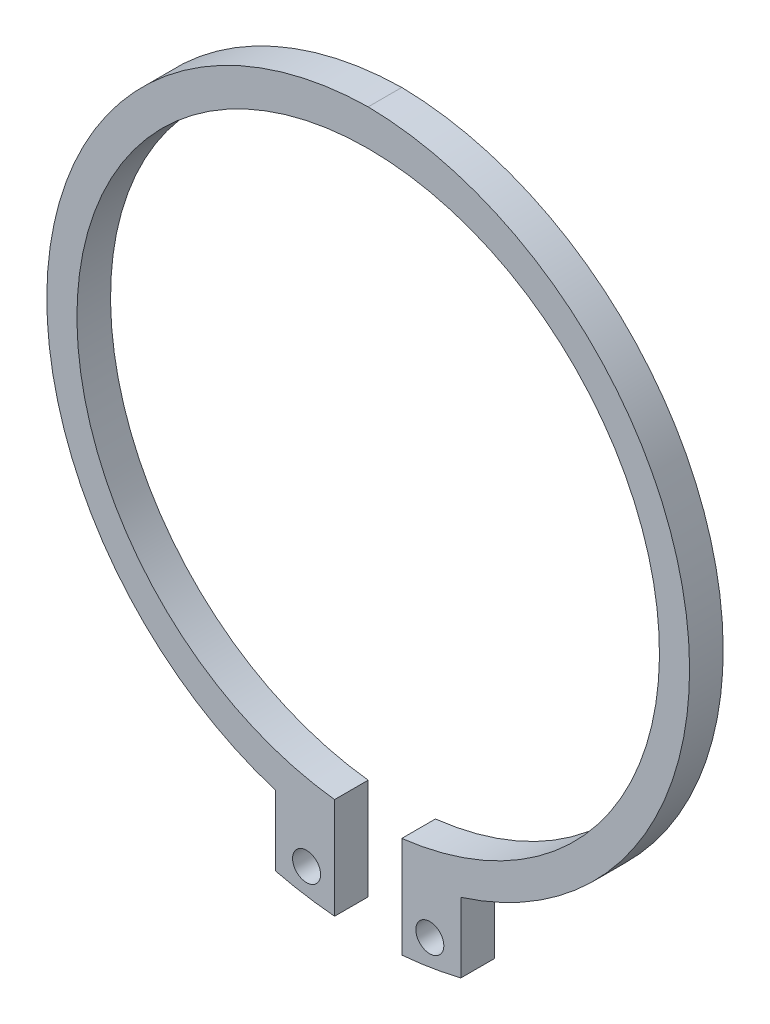
ISO-10303-21;
HEADER;
FILE_DESCRIPTION(('STEP AP214'),'2;1');
FILE_NAME('part.step','',(''),(''),'','','');
FILE_SCHEMA(('AUTOMOTIVE_DESIGN { 1 0 10303 214 1 1 1 1 }'));
ENDSEC;
DATA;
#1=APPLICATION_CONTEXT('core data for automotive mechanical design processes');
#2=APPLICATION_PROTOCOL_DEFINITION('international standard','automotive_design',2000,#1);
#3=PRODUCT_CONTEXT('',#1,'mechanical');
#4=PRODUCT('Part','Part','',(#3));
#5=PRODUCT_RELATED_PRODUCT_CATEGORY('part','',(#4));
#6=PRODUCT_DEFINITION_FORMATION('','',#4);
#7=PRODUCT_DEFINITION_CONTEXT('part definition',#1,'design');
#8=PRODUCT_DEFINITION('design','',#6,#7);
#9=PRODUCT_DEFINITION_SHAPE('','',#8);
#10=(LENGTH_UNIT() NAMED_UNIT(*) SI_UNIT(.MILLI.,.METRE.));
#11=(NAMED_UNIT(*) PLANE_ANGLE_UNIT() SI_UNIT($,.RADIAN.));
#12=(NAMED_UNIT(*) SI_UNIT($,.STERADIAN.) SOLID_ANGLE_UNIT());
#13=UNCERTAINTY_MEASURE_WITH_UNIT(LENGTH_MEASURE(1.E-05),#10,'distance_accuracy_value','');
#14=(GEOMETRIC_REPRESENTATION_CONTEXT(3) GLOBAL_UNCERTAINTY_ASSIGNED_CONTEXT((#13)) GLOBAL_UNIT_ASSIGNED_CONTEXT((#10,
#11,#12)) REPRESENTATION_CONTEXT('',''));
#15=CARTESIAN_POINT('',(0.,0.,0.));
#16=DIRECTION('',(0.,0.,1.));
#17=DIRECTION('',(1.,0.,0.));
#18=AXIS2_PLACEMENT_3D('',#15,#16,#17);
#19=CARTESIAN_POINT('',(5.5,-32.25,1.5));
#20=DIRECTION('',(0.,0.,-1.));
#21=DIRECTION('',(1.,0.,0.));
#22=AXIS2_PLACEMENT_3D('',#19,#20,#21);
#23=CYLINDRICAL_SURFACE('',#22,1.25);
#24=CARTESIAN_POINT('',(5.5,-32.25,0.));
#25=DIRECTION('',(0.,0.,1.));
#26=DIRECTION('',(1.,0.,0.));
#27=AXIS2_PLACEMENT_3D('',#24,#25,#26);
#28=CIRCLE('',#27,1.25);
#29=CARTESIAN_POINT('',(6.75,-32.25,0.));
#30=VERTEX_POINT('',#29);
#31=EDGE_CURVE('E11',#30,#30,#28,.T.);
#32=ORIENTED_EDGE('',*,*,#31,.F.);
#33=EDGE_LOOP('',(#32));
#34=FACE_BOUND('',#33,.T.);
#35=CARTESIAN_POINT('',(5.5,-32.25,3.));
#36=DIRECTION('',(0.,0.,-1.));
#37=DIRECTION('',(1.,0.,0.));
#38=AXIS2_PLACEMENT_3D('',#35,#36,#37);
#39=CIRCLE('',#38,1.25);
#40=CARTESIAN_POINT('',(6.75,-32.25,3.));
#41=VERTEX_POINT('',#40);
#42=EDGE_CURVE('E155',#41,#41,#39,.T.);
#43=ORIENTED_EDGE('',*,*,#42,.F.);
#44=EDGE_LOOP('',(#43));
#45=FACE_BOUND('',#44,.T.);
#46=ADVANCED_FACE('F40',(#34,#45),#23,.F.);
#47=CARTESIAN_POINT('',(-5.5,-32.25,1.5));
#48=DIRECTION('',(0.,0.,-1.));
#49=DIRECTION('',(1.,0.,0.));
#50=AXIS2_PLACEMENT_3D('',#47,#48,#49);
#51=CYLINDRICAL_SURFACE('',#50,1.25);
#52=CARTESIAN_POINT('',(-5.5,-32.25,0.));
#53=DIRECTION('',(0.,0.,1.));
#54=DIRECTION('',(1.,0.,0.));
#55=AXIS2_PLACEMENT_3D('',#52,#53,#54);
#56=CIRCLE('',#55,1.25);
#57=CARTESIAN_POINT('',(-4.25,-32.25,0.));
#58=VERTEX_POINT('',#57);
#59=EDGE_CURVE('E50',#58,#58,#56,.T.);
#60=ORIENTED_EDGE('',*,*,#59,.F.);
#61=EDGE_LOOP('',(#60));
#62=FACE_BOUND('',#61,.T.);
#63=CARTESIAN_POINT('',(-5.5,-32.25,3.));
#64=DIRECTION('',(0.,0.,-1.));
#65=DIRECTION('',(1.,0.,0.));
#66=AXIS2_PLACEMENT_3D('',#63,#64,#65);
#67=CIRCLE('',#66,1.25);
#68=CARTESIAN_POINT('',(-4.25,-32.25,3.));
#69=VERTEX_POINT('',#68);
#70=EDGE_CURVE('E149',#69,#69,#67,.T.);
#71=ORIENTED_EDGE('',*,*,#70,.F.);
#72=EDGE_LOOP('',(#71));
#73=FACE_BOUND('',#72,.T.);
#74=ADVANCED_FACE('F268',(#62,#73),#51,.F.);
#75=CARTESIAN_POINT('',(3.,-21.375,1.5));
#76=DIRECTION('',(-1.,0.,0.));
#77=DIRECTION('',(0.,0.,1.));
#78=AXIS2_PLACEMENT_3D('',#75,#76,#77);
#79=PLANE('',#78);
#80=DIRECTION('',(0.,0.,1.));
#81=VECTOR('',#80,1.);
#82=CARTESIAN_POINT('',(3.,-34.8479621922824,-0.00100000000000013));
#83=LINE('',#82,#81);
#84=CARTESIAN_POINT('',(3.,-34.8479621922824,0.));
#85=VERTEX_POINT('',#84);
#86=CARTESIAN_POINT('',(3.,-34.8479621922824,3.));
#87=VERTEX_POINT('',#86);
#88=EDGE_CURVE('E126',#85,#87,#83,.T.);
#89=ORIENTED_EDGE('',*,*,#88,.T.);
#90=DIRECTION('',(0.,-1.,0.));
#91=VECTOR('',#90,1.);
#92=CARTESIAN_POINT('',(3.,-11.8490318690869,3.));
#93=LINE('',#92,#91);
#94=CARTESIAN_POINT('',(3.,-25.8263431402899,3.));
#95=VERTEX_POINT('',#94);
#96=EDGE_CURVE('E138',#95,#87,#93,.T.);
#97=ORIENTED_EDGE('',*,*,#96,.F.);
#98=DIRECTION('',(0.,0.,1.));
#99=VECTOR('',#98,1.);
#100=CARTESIAN_POINT('',(3.,-25.8263431402899,1.5));
#101=LINE('',#100,#99);
#102=CARTESIAN_POINT('',(3.,-25.8263431402899,0.));
#103=VERTEX_POINT('',#102);
#104=EDGE_CURVE('E169',#103,#95,#101,.T.);
#105=ORIENTED_EDGE('',*,*,#104,.F.);
#106=DIRECTION('',(0.,1.,0.));
#107=VECTOR('',#106,1.);
#108=CARTESIAN_POINT('',(3.,-11.8490318690869,0.));
#109=LINE('',#108,#107);
#110=EDGE_CURVE('E140',#85,#103,#109,.T.);
#111=ORIENTED_EDGE('',*,*,#110,.F.);
#112=EDGE_LOOP('',(#89,#97,#105,#111));
#113=FACE_BOUND('',#112,.T.);
#114=ADVANCED_FACE('F136',(#113),#79,.T.);
#115=CARTESIAN_POINT('',(-3.,-21.375,1.5));
#116=DIRECTION('',(1.,0.,0.));
#117=DIRECTION('',(0.,0.,-1.));
#118=AXIS2_PLACEMENT_3D('',#115,#116,#117);
#119=PLANE('',#118);
#120=DIRECTION('',(0.,0.,1.));
#121=VECTOR('',#120,1.);
#122=CARTESIAN_POINT('',(-3.,-34.8479621922823,-0.00100000000000013));
#123=LINE('',#122,#121);
#124=CARTESIAN_POINT('',(-3.,-34.8479621922823,0.));
#125=VERTEX_POINT('',#124);
#126=CARTESIAN_POINT('',(-3.,-34.8479621922823,3.));
#127=VERTEX_POINT('',#126);
#128=EDGE_CURVE('E58',#125,#127,#123,.T.);
#129=ORIENTED_EDGE('',*,*,#128,.F.);
#130=DIRECTION('',(0.,-1.,0.));
#131=VECTOR('',#130,1.);
#132=CARTESIAN_POINT('',(-3.,-11.8490318690869,0.));
#133=LINE('',#132,#131);
#134=CARTESIAN_POINT('',(-3.,-25.8263431402899,0.));
#135=VERTEX_POINT('',#134);
#136=EDGE_CURVE('E199',#135,#125,#133,.T.);
#137=ORIENTED_EDGE('',*,*,#136,.F.);
#138=DIRECTION('',(0.,0.,-1.));
#139=VECTOR('',#138,1.);
#140=CARTESIAN_POINT('',(-3.,-25.8263431402899,1.5));
#141=LINE('',#140,#139);
#142=CARTESIAN_POINT('',(-3.,-25.8263431402899,3.));
#143=VERTEX_POINT('',#142);
#144=EDGE_CURVE('E172',#143,#135,#141,.T.);
#145=ORIENTED_EDGE('',*,*,#144,.F.);
#146=DIRECTION('',(0.,1.,0.));
#147=VECTOR('',#146,1.);
#148=CARTESIAN_POINT('',(-3.,-11.8490318690869,3.));
#149=LINE('',#148,#147);
#150=EDGE_CURVE('E157',#127,#143,#149,.T.);
#151=ORIENTED_EDGE('',*,*,#150,.F.);
#152=EDGE_LOOP('',(#129,#137,#145,#151));
#153=FACE_BOUND('',#152,.T.);
#154=ADVANCED_FACE('F255',(#153),#119,.T.);
#155=CARTESIAN_POINT('',(-14.9876790173679,-2.32306373817371,0.));
#156=DIRECTION('',(0.,0.,1.));
#157=DIRECTION('',(1.,0.,0.));
#158=AXIS2_PLACEMENT_3D('',#155,#156,#157);
#159=PLANE('',#158);
#160=ORIENTED_EDGE('',*,*,#31,.T.);
#161=EDGE_LOOP('',(#160));
#162=FACE_BOUND('',#161,.T.);
#163=ORIENTED_EDGE('',*,*,#59,.T.);
#164=EDGE_LOOP('',(#163));
#165=FACE_BOUND('',#164,.T.);
#166=DIRECTION('',(0.,1.,0.));
#167=VECTOR('',#166,1.);
#168=CARTESIAN_POINT('',(8.26695124713703,-35.8080998808574,0.));
#169=LINE('',#168,#167);
#170=CARTESIAN_POINT('',(8.26695124713703,-33.9865259267687,0.));
#171=VERTEX_POINT('',#170);
#172=CARTESIAN_POINT('',(8.26695124713703,-27.7455998808574,0.));
#173=VERTEX_POINT('',#172);
#174=EDGE_CURVE('E191',#171,#173,#169,.T.);
#175=ORIENTED_EDGE('',*,*,#174,.F.);
#176=CARTESIAN_POINT('',(0.,0.0266755304849792,0.));
#177=DIRECTION('',(0.,0.,1.));
#178=DIRECTION('',(1.,0.,0.));
#179=AXIS2_PLACEMENT_3D('',#176,#177,#178);
#180=CIRCLE('',#179,35.0034334929342);
#181=EDGE_CURVE('E132',#85,#171,#180,.T.);
#182=ORIENTED_EDGE('',*,*,#181,.F.);
#183=ORIENTED_EDGE('',*,*,#110,.T.);
#184=CARTESIAN_POINT('',(0.,0.,0.));
#185=DIRECTION('',(0.,0.,-1.));
#186=DIRECTION('',(-1.,0.,0.));
#187=AXIS2_PLACEMENT_3D('',#184,#185,#186);
#188=CIRCLE('',#187,26.);
#189=EDGE_CURVE('E160',#135,#103,#188,.T.);
#190=ORIENTED_EDGE('',*,*,#189,.F.);
#191=ORIENTED_EDGE('',*,*,#136,.T.);
#192=CARTESIAN_POINT('',(0.,0.0266755304849792,0.));
#193=DIRECTION('',(0.,0.,1.));
#194=DIRECTION('',(1.,0.,0.));
#195=AXIS2_PLACEMENT_3D('',#192,#193,#194);
#196=CIRCLE('',#195,35.0034334929342);
#197=CARTESIAN_POINT('',(-8.26695124713705,-33.9865259267687,0.));
#198=VERTEX_POINT('',#197);
#199=EDGE_CURVE('E239',#198,#125,#196,.T.);
#200=ORIENTED_EDGE('',*,*,#199,.F.);
#201=DIRECTION('',(0.,1.,0.));
#202=VECTOR('',#201,1.);
#203=CARTESIAN_POINT('',(-8.26695124713703,-35.8080998808574,0.));
#204=LINE('',#203,#202);
#205=CARTESIAN_POINT('',(-8.26695124713703,-27.7455998808574,0.));
#206=VERTEX_POINT('',#205);
#207=EDGE_CURVE('E198',#198,#206,#204,.T.);
#208=ORIENTED_EDGE('',*,*,#207,.T.);
#209=CARTESIAN_POINT('',(0.469411108907729,0.0717794076376238,0.));
#210=DIRECTION('',(0.,0.,1.));
#211=DIRECTION('',(1.,0.,0.));
#212=AXIS2_PLACEMENT_3D('',#209,#210,#211);
#213=CIRCLE('',#212,29.156999463184);
#214=CARTESIAN_POINT('',(0.,29.225,0.));
#215=VERTEX_POINT('',#214);
#216=EDGE_CURVE('E163',#215,#206,#213,.T.);
#217=ORIENTED_EDGE('',*,*,#216,.F.);
#218=CARTESIAN_POINT('',(-0.469411108907728,0.0717794076376238,0.));
#219=DIRECTION('',(0.,0.,1.));
#220=DIRECTION('',(-1.,0.,0.));
#221=AXIS2_PLACEMENT_3D('',#218,#219,#220);
#222=CIRCLE('',#221,29.156999463184);
#223=EDGE_CURVE('E176',#173,#215,#222,.T.);
#224=ORIENTED_EDGE('',*,*,#223,.F.);
#225=EDGE_LOOP('',(#175,#182,#183,#190,#191,#200,#208,#217,#224));
#226=FACE_BOUND('',#225,.T.);
#227=ADVANCED_FACE('F238',(#162,#165,#226),#159,.F.);
#228=CARTESIAN_POINT('',(-0.469411108907729,0.0717794076376238,3.));
#229=DIRECTION('',(0.,0.,1.));
#230=DIRECTION('',(-1.,0.,0.));
#231=AXIS2_PLACEMENT_3D('',#228,#229,#230);
#232=CYLINDRICAL_SURFACE('',#231,29.156999463184);
#233=ORIENTED_EDGE('',*,*,#223,.T.);
#234=DIRECTION('',(0.,0.,1.));
#235=VECTOR('',#234,1.);
#236=CARTESIAN_POINT('',(0.,29.225,0.));
#237=LINE('',#236,#235);
#238=CARTESIAN_POINT('',(0.,29.225,3.));
#239=VERTEX_POINT('',#238);
#240=EDGE_CURVE('E173',#215,#239,#237,.T.);
#241=ORIENTED_EDGE('',*,*,#240,.T.);
#242=CARTESIAN_POINT('',(-0.469411108907729,0.0717794076376238,3.));
#243=DIRECTION('',(0.,0.,-1.));
#244=DIRECTION('',(-1.,0.,0.));
#245=AXIS2_PLACEMENT_3D('',#242,#243,#244);
#246=CIRCLE('',#245,29.156999463184);
#247=CARTESIAN_POINT('',(8.26695124713703,-27.7455998808574,3.));
#248=VERTEX_POINT('',#247);
#249=EDGE_CURVE('E177',#239,#248,#246,.T.);
#250=ORIENTED_EDGE('',*,*,#249,.T.);
#251=DIRECTION('',(0.,0.,-1.));
#252=VECTOR('',#251,1.);
#253=CARTESIAN_POINT('',(8.26695124713703,-27.7455998808574,3.));
#254=LINE('',#253,#252);
#255=EDGE_CURVE('E194',#248,#173,#254,.T.);
#256=ORIENTED_EDGE('',*,*,#255,.T.);
#257=EDGE_LOOP('',(#233,#241,#250,#256));
#258=FACE_BOUND('',#257,.T.);
#259=ADVANCED_FACE('F282',(#258),#232,.T.);
#260=CARTESIAN_POINT('',(8.26695124713703,-31.7768498808574,3.));
#261=DIRECTION('',(1.,0.,0.));
#262=DIRECTION('',(0.,-1.,0.));
#263=AXIS2_PLACEMENT_3D('',#260,#261,#262);
#264=PLANE('',#263);
#265=DIRECTION('',(0.,0.,1.));
#266=VECTOR('',#265,1.);
#267=CARTESIAN_POINT('',(8.26695124713703,-33.9865259267687,-0.00100000000000013));
#268=LINE('',#267,#266);
#269=CARTESIAN_POINT('',(8.26695124713703,-33.9865259267687,3.));
#270=VERTEX_POINT('',#269);
#271=EDGE_CURVE('E66',#171,#270,#268,.T.);
#272=ORIENTED_EDGE('',*,*,#271,.F.);
#273=ORIENTED_EDGE('',*,*,#174,.T.);
#274=ORIENTED_EDGE('',*,*,#255,.F.);
#275=DIRECTION('',(0.,1.,0.));
#276=VECTOR('',#275,1.);
#277=CARTESIAN_POINT('',(8.26695124713703,-35.8080998808574,3.));
#278=LINE('',#277,#276);
#279=EDGE_CURVE('E150',#270,#248,#278,.T.);
#280=ORIENTED_EDGE('',*,*,#279,.F.);
#281=EDGE_LOOP('',(#272,#273,#274,#280));
#282=FACE_BOUND('',#281,.T.);
#283=ADVANCED_FACE('F264',(#282),#264,.T.);
#284=CARTESIAN_POINT('',(0.469411108907729,0.0717794076376238,0.));
#285=DIRECTION('',(0.,0.,-1.));
#286=DIRECTION('',(1.,0.,0.));
#287=AXIS2_PLACEMENT_3D('',#284,#285,#286);
#288=CYLINDRICAL_SURFACE('',#287,29.156999463184);
#289=CARTESIAN_POINT('',(0.469411108907729,0.0717794076376238,3.));
#290=DIRECTION('',(0.,0.,-1.));
#291=DIRECTION('',(1.,0.,0.));
#292=AXIS2_PLACEMENT_3D('',#289,#290,#291);
#293=CIRCLE('',#292,29.156999463184);
#294=CARTESIAN_POINT('',(-8.26695124713703,-27.7455998808574,3.));
#295=VERTEX_POINT('',#294);
#296=EDGE_CURVE('E167',#295,#239,#293,.T.);
#297=ORIENTED_EDGE('',*,*,#296,.T.);
#298=ORIENTED_EDGE('',*,*,#240,.F.);
#299=ORIENTED_EDGE('',*,*,#216,.T.);
#300=DIRECTION('',(0.,0.,1.));
#301=VECTOR('',#300,1.);
#302=CARTESIAN_POINT('',(-8.26695124713703,-27.7455998808574,0.));
#303=LINE('',#302,#301);
#304=EDGE_CURVE('E168',#206,#295,#303,.T.);
#305=ORIENTED_EDGE('',*,*,#304,.T.);
#306=EDGE_LOOP('',(#297,#298,#299,#305));
#307=FACE_BOUND('',#306,.T.);
#308=ADVANCED_FACE('F184',(#307),#288,.T.);
#309=CARTESIAN_POINT('',(0.,0.,0.));
#310=DIRECTION('',(0.,0.,-1.));
#311=DIRECTION('',(1.,0.,0.));
#312=AXIS2_PLACEMENT_3D('',#309,#310,#311);
#313=CYLINDRICAL_SURFACE('',#312,26.);
#314=ORIENTED_EDGE('',*,*,#104,.T.);
#315=CARTESIAN_POINT('',(0.,0.,3.));
#316=DIRECTION('',(0.,0.,-1.));
#317=DIRECTION('',(-1.,0.,0.));
#318=AXIS2_PLACEMENT_3D('',#315,#316,#317);
#319=CIRCLE('',#318,26.);
#320=EDGE_CURVE('E142',#143,#95,#319,.T.);
#321=ORIENTED_EDGE('',*,*,#320,.F.);
#322=ORIENTED_EDGE('',*,*,#144,.T.);
#323=ORIENTED_EDGE('',*,*,#189,.T.);
#324=EDGE_LOOP('',(#314,#321,#322,#323));
#325=FACE_BOUND('',#324,.T.);
#326=ADVANCED_FACE('F256',(#325),#313,.F.);
#327=CARTESIAN_POINT('',(-8.26695124713703,-31.7768498808574,0.));
#328=DIRECTION('',(-1.,0.,0.));
#329=DIRECTION('',(0.,-1.,0.));
#330=AXIS2_PLACEMENT_3D('',#327,#328,#329);
#331=PLANE('',#330);
#332=DIRECTION('',(0.,0.,1.));
#333=VECTOR('',#332,1.);
#334=CARTESIAN_POINT('',(-8.26695124713705,-33.9865259267687,-0.00100000000000013));
#335=LINE('',#334,#333);
#336=CARTESIAN_POINT('',(-8.26695124713705,-33.9865259267687,3.));
#337=VERTEX_POINT('',#336);
#338=EDGE_CURVE('E240',#198,#337,#335,.T.);
#339=ORIENTED_EDGE('',*,*,#338,.T.);
#340=DIRECTION('',(0.,1.,0.));
#341=VECTOR('',#340,1.);
#342=CARTESIAN_POINT('',(-8.26695124713703,-35.8080998808574,3.));
#343=LINE('',#342,#341);
#344=EDGE_CURVE('E44',#337,#295,#343,.T.);
#345=ORIENTED_EDGE('',*,*,#344,.T.);
#346=ORIENTED_EDGE('',*,*,#304,.F.);
#347=ORIENTED_EDGE('',*,*,#207,.F.);
#348=EDGE_LOOP('',(#339,#345,#346,#347));
#349=FACE_BOUND('',#348,.T.);
#350=ADVANCED_FACE('F42',(#349),#331,.T.);
#351=CARTESIAN_POINT('',(-14.9876790173679,-2.32306373817371,3.));
#352=DIRECTION('',(0.,0.,1.));
#353=DIRECTION('',(1.,0.,0.));
#354=AXIS2_PLACEMENT_3D('',#351,#352,#353);
#355=PLANE('',#354);
#356=CARTESIAN_POINT('',(0.,0.0266755304849792,3.));
#357=DIRECTION('',(0.,0.,-1.));
#358=DIRECTION('',(1.,0.,0.));
#359=AXIS2_PLACEMENT_3D('',#356,#357,#358);
#360=CIRCLE('',#359,35.0034334929342);
#361=EDGE_CURVE('E123',#270,#87,#360,.T.);
#362=ORIENTED_EDGE('',*,*,#361,.F.);
#363=ORIENTED_EDGE('',*,*,#279,.T.);
#364=ORIENTED_EDGE('',*,*,#249,.F.);
#365=ORIENTED_EDGE('',*,*,#296,.F.);
#366=ORIENTED_EDGE('',*,*,#344,.F.);
#367=CARTESIAN_POINT('',(0.,0.0266755304849792,3.));
#368=DIRECTION('',(0.,0.,-1.));
#369=DIRECTION('',(1.,0.,0.));
#370=AXIS2_PLACEMENT_3D('',#367,#368,#369);
#371=CIRCLE('',#370,35.0034334929342);
#372=EDGE_CURVE('E245',#127,#337,#371,.T.);
#373=ORIENTED_EDGE('',*,*,#372,.F.);
#374=ORIENTED_EDGE('',*,*,#150,.T.);
#375=ORIENTED_EDGE('',*,*,#320,.T.);
#376=ORIENTED_EDGE('',*,*,#96,.T.);
#377=EDGE_LOOP('',(#362,#363,#364,#365,#366,#373,#374,#375,#376));
#378=FACE_BOUND('',#377,.T.);
#379=ORIENTED_EDGE('',*,*,#42,.T.);
#380=EDGE_LOOP('',(#379));
#381=FACE_BOUND('',#380,.T.);
#382=ORIENTED_EDGE('',*,*,#70,.T.);
#383=EDGE_LOOP('',(#382));
#384=FACE_BOUND('',#383,.T.);
#385=ADVANCED_FACE('F145',(#378,#381,#384),#355,.T.);
#386=CARTESIAN_POINT('',(0.,0.0266755304849792,-0.00100000000000013));
#387=DIRECTION('',(0.,0.,1.));
#388=DIRECTION('',(1.,0.,0.));
#389=AXIS2_PLACEMENT_3D('',#386,#387,#388);
#390=CYLINDRICAL_SURFACE('',#389,35.0034334929342);
#391=ORIENTED_EDGE('',*,*,#199,.T.);
#392=ORIENTED_EDGE('',*,*,#128,.T.);
#393=ORIENTED_EDGE('',*,*,#372,.T.);
#394=ORIENTED_EDGE('',*,*,#338,.F.);
#395=EDGE_LOOP('',(#391,#392,#393,#394));
#396=FACE_BOUND('',#395,.T.);
#397=ADVANCED_FACE('F252',(#396),#390,.T.);
#398=CARTESIAN_POINT('',(0.,0.0266755304849792,-0.00100000000000013));
#399=DIRECTION('',(0.,0.,1.));
#400=DIRECTION('',(1.,0.,0.));
#401=AXIS2_PLACEMENT_3D('',#398,#399,#400);
#402=CYLINDRICAL_SURFACE('',#401,35.0034334929342);
#403=ORIENTED_EDGE('',*,*,#181,.T.);
#404=ORIENTED_EDGE('',*,*,#271,.T.);
#405=ORIENTED_EDGE('',*,*,#361,.T.);
#406=ORIENTED_EDGE('',*,*,#88,.F.);
#407=EDGE_LOOP('',(#403,#404,#405,#406));
#408=FACE_BOUND('',#407,.T.);
#409=ADVANCED_FACE('F125',(#408),#402,.T.);
#410=CLOSED_SHELL('',(#46,#74,#114,#154,#227,#259,#283,#308,#326,#350,#385,#397,#409));
#411=MANIFOLD_SOLID_BREP('B2',#410);
#412=ADVANCED_BREP_SHAPE_REPRESENTATION('',(#18,#411),#14);
#413=SHAPE_DEFINITION_REPRESENTATION(#9,#412);
ENDSEC;
END-ISO-10303-21;
